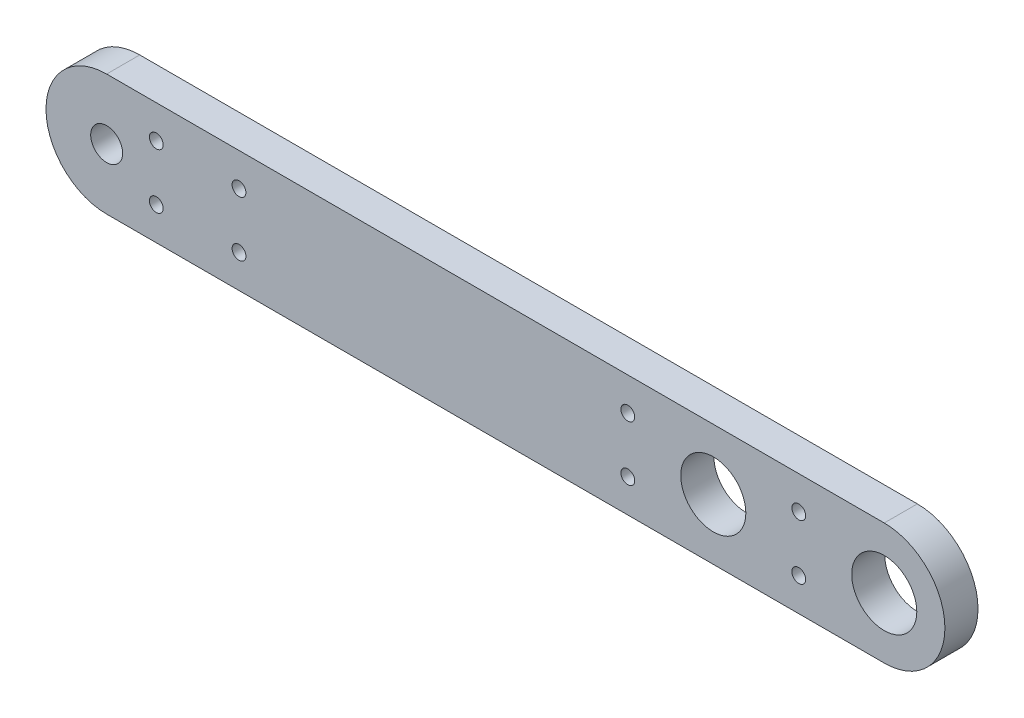
ISO-10303-21;
HEADER;
FILE_DESCRIPTION(('STEP AP214'),'2;1');
FILE_NAME('part.step','',(''),(''),'','','');
FILE_SCHEMA(('AUTOMOTIVE_DESIGN { 1 0 10303 214 1 1 1 1 }'));
ENDSEC;
DATA;
#1=APPLICATION_CONTEXT('core data for automotive mechanical design processes');
#2=APPLICATION_PROTOCOL_DEFINITION('international standard','automotive_design',2000,#1);
#3=PRODUCT_CONTEXT('',#1,'mechanical');
#4=PRODUCT('Part','Part','',(#3));
#5=PRODUCT_RELATED_PRODUCT_CATEGORY('part','',(#4));
#6=PRODUCT_DEFINITION_FORMATION('','',#4);
#7=PRODUCT_DEFINITION_CONTEXT('part definition',#1,'design');
#8=PRODUCT_DEFINITION('design','',#6,#7);
#9=PRODUCT_DEFINITION_SHAPE('','',#8);
#10=(LENGTH_UNIT() NAMED_UNIT(*) SI_UNIT(.MILLI.,.METRE.));
#11=(NAMED_UNIT(*) PLANE_ANGLE_UNIT() SI_UNIT($,.RADIAN.));
#12=(NAMED_UNIT(*) SI_UNIT($,.STERADIAN.) SOLID_ANGLE_UNIT());
#13=UNCERTAINTY_MEASURE_WITH_UNIT(LENGTH_MEASURE(1.E-05),#10,'distance_accuracy_value','');
#14=(GEOMETRIC_REPRESENTATION_CONTEXT(3) GLOBAL_UNCERTAINTY_ASSIGNED_CONTEXT((#13)) GLOBAL_UNIT_ASSIGNED_CONTEXT((#10,
#11,#12)) REPRESENTATION_CONTEXT('',''));
#15=CARTESIAN_POINT('',(0.,0.,0.));
#16=DIRECTION('',(0.,0.,1.));
#17=DIRECTION('',(1.,0.,0.));
#18=AXIS2_PLACEMENT_3D('',#15,#16,#17);
#19=CARTESIAN_POINT('',(15.5,0.,3.));
#20=DIRECTION('',(0.,0.,1.));
#21=DIRECTION('',(1.,0.,0.));
#22=AXIS2_PLACEMENT_3D('',#19,#20,#21);
#23=PLANE('',#22);
#24=CARTESIAN_POINT('',(7.75,-2.49999999999999,3.));
#25=DIRECTION('',(0.,0.,1.));
#26=DIRECTION('',(1.,0.,0.));
#27=AXIS2_PLACEMENT_3D('',#24,#25,#26);
#28=CIRCLE('',#27,0.625000000000001);
#29=CARTESIAN_POINT('',(8.375,-2.49999999999999,3.));
#30=VERTEX_POINT('',#29);
#31=EDGE_CURVE('E173',#30,#30,#28,.T.);
#32=ORIENTED_EDGE('',*,*,#31,.F.);
#33=EDGE_LOOP('',(#32));
#34=FACE_BOUND('',#33,.T.);
#35=CARTESIAN_POINT('',(-7.75,-2.49999999999999,3.));
#36=DIRECTION('',(0.,0.,1.));
#37=DIRECTION('',(1.,0.,0.));
#38=AXIS2_PLACEMENT_3D('',#35,#36,#37);
#39=CIRCLE('',#38,0.625);
#40=CARTESIAN_POINT('',(-7.125,-2.49999999999999,3.));
#41=VERTEX_POINT('',#40);
#42=EDGE_CURVE('E167',#41,#41,#39,.T.);
#43=ORIENTED_EDGE('',*,*,#42,.F.);
#44=EDGE_LOOP('',(#43));
#45=FACE_BOUND('',#44,.T.);
#46=CARTESIAN_POINT('',(-50.5,-2.49999999999999,3.));
#47=DIRECTION('',(0.,0.,1.));
#48=DIRECTION('',(1.,0.,0.));
#49=AXIS2_PLACEMENT_3D('',#46,#47,#48);
#50=CIRCLE('',#49,0.625000000000001);
#51=CARTESIAN_POINT('',(-49.875,-2.49999999999999,3.));
#52=VERTEX_POINT('',#51);
#53=EDGE_CURVE('E161',#52,#52,#50,.T.);
#54=ORIENTED_EDGE('',*,*,#53,.F.);
#55=EDGE_LOOP('',(#54));
#56=FACE_BOUND('',#55,.T.);
#57=CARTESIAN_POINT('',(-43.,-2.49999999999999,3.));
#58=DIRECTION('',(0.,0.,1.));
#59=DIRECTION('',(1.,0.,0.));
#60=AXIS2_PLACEMENT_3D('',#57,#58,#59);
#61=CIRCLE('',#60,0.625000000000001);
#62=CARTESIAN_POINT('',(-42.375,-2.49999999999999,3.));
#63=VERTEX_POINT('',#62);
#64=EDGE_CURVE('E155',#63,#63,#61,.T.);
#65=ORIENTED_EDGE('',*,*,#64,.F.);
#66=EDGE_LOOP('',(#65));
#67=FACE_BOUND('',#66,.T.);
#68=CARTESIAN_POINT('',(7.75,2.49999999999999,3.));
#69=DIRECTION('',(0.,0.,1.));
#70=DIRECTION('',(1.,0.,0.));
#71=AXIS2_PLACEMENT_3D('',#68,#69,#70);
#72=CIRCLE('',#71,0.625000000000001);
#73=CARTESIAN_POINT('',(8.375,2.49999999999999,3.));
#74=VERTEX_POINT('',#73);
#75=EDGE_CURVE('E149',#74,#74,#72,.T.);
#76=ORIENTED_EDGE('',*,*,#75,.F.);
#77=EDGE_LOOP('',(#76));
#78=FACE_BOUND('',#77,.T.);
#79=CARTESIAN_POINT('',(-7.75,2.49999999999999,3.));
#80=DIRECTION('',(0.,0.,1.));
#81=DIRECTION('',(1.,0.,0.));
#82=AXIS2_PLACEMENT_3D('',#79,#80,#81);
#83=CIRCLE('',#82,0.625);
#84=CARTESIAN_POINT('',(-7.125,2.49999999999999,3.));
#85=VERTEX_POINT('',#84);
#86=EDGE_CURVE('E143',#85,#85,#83,.T.);
#87=ORIENTED_EDGE('',*,*,#86,.F.);
#88=EDGE_LOOP('',(#87));
#89=FACE_BOUND('',#88,.T.);
#90=CARTESIAN_POINT('',(-50.5,2.49999999999999,3.));
#91=DIRECTION('',(0.,0.,1.));
#92=DIRECTION('',(1.,0.,0.));
#93=AXIS2_PLACEMENT_3D('',#90,#91,#92);
#94=CIRCLE('',#93,0.625000000000001);
#95=CARTESIAN_POINT('',(-49.875,2.49999999999999,3.));
#96=VERTEX_POINT('',#95);
#97=EDGE_CURVE('E137',#96,#96,#94,.T.);
#98=ORIENTED_EDGE('',*,*,#97,.F.);
#99=EDGE_LOOP('',(#98));
#100=FACE_BOUND('',#99,.T.);
#101=CARTESIAN_POINT('',(-43.,2.49999999999999,3.));
#102=DIRECTION('',(0.,0.,1.));
#103=DIRECTION('',(1.,0.,0.));
#104=AXIS2_PLACEMENT_3D('',#101,#102,#103);
#105=CIRCLE('',#104,0.625000000000001);
#106=CARTESIAN_POINT('',(-42.375,2.49999999999999,3.));
#107=VERTEX_POINT('',#106);
#108=EDGE_CURVE('E131',#107,#107,#105,.T.);
#109=ORIENTED_EDGE('',*,*,#108,.F.);
#110=EDGE_LOOP('',(#109));
#111=FACE_BOUND('',#110,.T.);
#112=CARTESIAN_POINT('',(0.,0.,3.));
#113=DIRECTION('',(0.,0.,1.));
#114=DIRECTION('',(1.,0.,0.));
#115=AXIS2_PLACEMENT_3D('',#112,#113,#114);
#116=CIRCLE('',#115,2.95);
#117=CARTESIAN_POINT('',(2.95,0.,3.));
#118=VERTEX_POINT('',#117);
#119=EDGE_CURVE('E114',#118,#118,#116,.T.);
#120=ORIENTED_EDGE('',*,*,#119,.F.);
#121=EDGE_LOOP('',(#120));
#122=FACE_BOUND('',#121,.T.);
#123=CARTESIAN_POINT('',(15.5,0.,3.));
#124=DIRECTION('',(0.,0.,1.));
#125=DIRECTION('',(1.,0.,0.));
#126=AXIS2_PLACEMENT_3D('',#123,#124,#125);
#127=CIRCLE('',#126,5.5);
#128=CARTESIAN_POINT('',(15.5,-5.5,3.));
#129=VERTEX_POINT('',#128);
#130=CARTESIAN_POINT('',(15.5,5.5,3.));
#131=VERTEX_POINT('',#130);
#132=EDGE_CURVE('E84',#129,#131,#127,.T.);
#133=ORIENTED_EDGE('',*,*,#132,.T.);
#134=DIRECTION('',(-1.,0.,0.));
#135=VECTOR('',#134,1.);
#136=CARTESIAN_POINT('',(15.5,5.5,3.));
#137=LINE('',#136,#135);
#138=CARTESIAN_POINT('',(-55.,5.49999999999999,3.));
#139=VERTEX_POINT('',#138);
#140=EDGE_CURVE('E79',#131,#139,#137,.T.);
#141=ORIENTED_EDGE('',*,*,#140,.T.);
#142=CARTESIAN_POINT('',(-55.,0.,3.));
#143=DIRECTION('',(0.,0.,1.));
#144=DIRECTION('',(1.,0.,0.));
#145=AXIS2_PLACEMENT_3D('',#142,#143,#144);
#146=CIRCLE('',#145,5.49999999999999);
#147=CARTESIAN_POINT('',(-55.,-5.49999999999999,3.));
#148=VERTEX_POINT('',#147);
#149=EDGE_CURVE('E82',#139,#148,#146,.T.);
#150=ORIENTED_EDGE('',*,*,#149,.T.);
#151=DIRECTION('',(1.,0.,0.));
#152=VECTOR('',#151,1.);
#153=CARTESIAN_POINT('',(-55.,-5.49999999999999,3.));
#154=LINE('',#153,#152);
#155=EDGE_CURVE('E49',#148,#129,#154,.T.);
#156=ORIENTED_EDGE('',*,*,#155,.T.);
#157=EDGE_LOOP('',(#133,#141,#150,#156));
#158=FACE_BOUND('',#157,.T.);
#159=CARTESIAN_POINT('',(-55.,0.,3.));
#160=DIRECTION('',(0.,0.,1.));
#161=DIRECTION('',(1.,0.,0.));
#162=AXIS2_PLACEMENT_3D('',#159,#160,#161);
#163=CIRCLE('',#162,1.45);
#164=CARTESIAN_POINT('',(-53.55,0.,3.));
#165=VERTEX_POINT('',#164);
#166=EDGE_CURVE('E99',#165,#165,#163,.T.);
#167=ORIENTED_EDGE('',*,*,#166,.F.);
#168=EDGE_LOOP('',(#167));
#169=FACE_BOUND('',#168,.T.);
#170=CARTESIAN_POINT('',(15.5,0.,3.));
#171=DIRECTION('',(0.,0.,1.));
#172=DIRECTION('',(1.,0.,0.));
#173=AXIS2_PLACEMENT_3D('',#170,#171,#172);
#174=CIRCLE('',#173,2.95);
#175=CARTESIAN_POINT('',(18.45,0.,3.));
#176=VERTEX_POINT('',#175);
#177=EDGE_CURVE('E120',#176,#176,#174,.T.);
#178=ORIENTED_EDGE('',*,*,#177,.F.);
#179=EDGE_LOOP('',(#178));
#180=FACE_BOUND('',#179,.T.);
#181=ADVANCED_FACE('F32',(#34,#45,#56,#67,#78,#89,#100,#111,#122,#158,#169,#180),#23,.T.);
#182=CARTESIAN_POINT('',(15.5,0.,0.));
#183=DIRECTION('',(0.,0.,1.));
#184=DIRECTION('',(1.,0.,0.));
#185=AXIS2_PLACEMENT_3D('',#182,#183,#184);
#186=PLANE('',#185);
#187=CARTESIAN_POINT('',(7.75,-2.49999999999999,0.));
#188=DIRECTION('',(0.,0.,1.));
#189=DIRECTION('',(1.,0.,0.));
#190=AXIS2_PLACEMENT_3D('',#187,#188,#189);
#191=CIRCLE('',#190,0.624999999999999);
#192=CARTESIAN_POINT('',(8.375,-2.49999999999999,0.));
#193=VERTEX_POINT('',#192);
#194=EDGE_CURVE('E170',#193,#193,#191,.T.);
#195=ORIENTED_EDGE('',*,*,#194,.T.);
#196=EDGE_LOOP('',(#195));
#197=FACE_BOUND('',#196,.T.);
#198=CARTESIAN_POINT('',(-7.75,-2.49999999999999,0.));
#199=DIRECTION('',(0.,0.,1.));
#200=DIRECTION('',(1.,0.,0.));
#201=AXIS2_PLACEMENT_3D('',#198,#199,#200);
#202=CIRCLE('',#201,0.624999999999999);
#203=CARTESIAN_POINT('',(-7.125,-2.49999999999999,0.));
#204=VERTEX_POINT('',#203);
#205=EDGE_CURVE('E164',#204,#204,#202,.T.);
#206=ORIENTED_EDGE('',*,*,#205,.T.);
#207=EDGE_LOOP('',(#206));
#208=FACE_BOUND('',#207,.T.);
#209=CARTESIAN_POINT('',(-50.5,-2.49999999999999,0.));
#210=DIRECTION('',(0.,0.,1.));
#211=DIRECTION('',(1.,0.,0.));
#212=AXIS2_PLACEMENT_3D('',#209,#210,#211);
#213=CIRCLE('',#212,0.625000000000001);
#214=CARTESIAN_POINT('',(-49.875,-2.49999999999999,0.));
#215=VERTEX_POINT('',#214);
#216=EDGE_CURVE('E158',#215,#215,#213,.T.);
#217=ORIENTED_EDGE('',*,*,#216,.T.);
#218=EDGE_LOOP('',(#217));
#219=FACE_BOUND('',#218,.T.);
#220=CARTESIAN_POINT('',(-43.,-2.49999999999999,0.));
#221=DIRECTION('',(0.,0.,1.));
#222=DIRECTION('',(1.,0.,0.));
#223=AXIS2_PLACEMENT_3D('',#220,#221,#222);
#224=CIRCLE('',#223,0.625000000000001);
#225=CARTESIAN_POINT('',(-42.375,-2.49999999999999,0.));
#226=VERTEX_POINT('',#225);
#227=EDGE_CURVE('E152',#226,#226,#224,.T.);
#228=ORIENTED_EDGE('',*,*,#227,.T.);
#229=EDGE_LOOP('',(#228));
#230=FACE_BOUND('',#229,.T.);
#231=CARTESIAN_POINT('',(7.75,2.49999999999999,0.));
#232=DIRECTION('',(0.,0.,1.));
#233=DIRECTION('',(1.,0.,0.));
#234=AXIS2_PLACEMENT_3D('',#231,#232,#233);
#235=CIRCLE('',#234,0.624999999999999);
#236=CARTESIAN_POINT('',(8.375,2.49999999999999,0.));
#237=VERTEX_POINT('',#236);
#238=EDGE_CURVE('E146',#237,#237,#235,.T.);
#239=ORIENTED_EDGE('',*,*,#238,.T.);
#240=EDGE_LOOP('',(#239));
#241=FACE_BOUND('',#240,.T.);
#242=CARTESIAN_POINT('',(-7.75,2.49999999999999,0.));
#243=DIRECTION('',(0.,0.,1.));
#244=DIRECTION('',(1.,0.,0.));
#245=AXIS2_PLACEMENT_3D('',#242,#243,#244);
#246=CIRCLE('',#245,0.624999999999999);
#247=CARTESIAN_POINT('',(-7.125,2.49999999999999,0.));
#248=VERTEX_POINT('',#247);
#249=EDGE_CURVE('E140',#248,#248,#246,.T.);
#250=ORIENTED_EDGE('',*,*,#249,.T.);
#251=EDGE_LOOP('',(#250));
#252=FACE_BOUND('',#251,.T.);
#253=CARTESIAN_POINT('',(-50.5,2.49999999999999,0.));
#254=DIRECTION('',(0.,0.,1.));
#255=DIRECTION('',(1.,0.,0.));
#256=AXIS2_PLACEMENT_3D('',#253,#254,#255);
#257=CIRCLE('',#256,0.625000000000001);
#258=CARTESIAN_POINT('',(-49.875,2.49999999999999,0.));
#259=VERTEX_POINT('',#258);
#260=EDGE_CURVE('E134',#259,#259,#257,.T.);
#261=ORIENTED_EDGE('',*,*,#260,.T.);
#262=EDGE_LOOP('',(#261));
#263=FACE_BOUND('',#262,.T.);
#264=CARTESIAN_POINT('',(-43.,2.49999999999999,0.));
#265=DIRECTION('',(0.,0.,1.));
#266=DIRECTION('',(1.,0.,0.));
#267=AXIS2_PLACEMENT_3D('',#264,#265,#266);
#268=CIRCLE('',#267,0.625000000000001);
#269=CARTESIAN_POINT('',(-42.375,2.49999999999999,0.));
#270=VERTEX_POINT('',#269);
#271=EDGE_CURVE('E126',#270,#270,#268,.T.);
#272=ORIENTED_EDGE('',*,*,#271,.T.);
#273=EDGE_LOOP('',(#272));
#274=FACE_BOUND('',#273,.T.);
#275=CARTESIAN_POINT('',(0.,0.,0.));
#276=DIRECTION('',(0.,0.,1.));
#277=DIRECTION('',(1.,0.,0.));
#278=AXIS2_PLACEMENT_3D('',#275,#276,#277);
#279=CIRCLE('',#278,2.95);
#280=CARTESIAN_POINT('',(2.95,0.,0.));
#281=VERTEX_POINT('',#280);
#282=EDGE_CURVE('E117',#281,#281,#279,.T.);
#283=ORIENTED_EDGE('',*,*,#282,.T.);
#284=EDGE_LOOP('',(#283));
#285=FACE_BOUND('',#284,.T.);
#286=CARTESIAN_POINT('',(15.5,0.,0.));
#287=DIRECTION('',(0.,0.,1.));
#288=DIRECTION('',(1.,0.,0.));
#289=AXIS2_PLACEMENT_3D('',#286,#287,#288);
#290=CIRCLE('',#289,5.5);
#291=CARTESIAN_POINT('',(15.5,-5.5,0.));
#292=VERTEX_POINT('',#291);
#293=CARTESIAN_POINT('',(15.5,5.5,0.));
#294=VERTEX_POINT('',#293);
#295=EDGE_CURVE('E96',#292,#294,#290,.T.);
#296=ORIENTED_EDGE('',*,*,#295,.F.);
#297=DIRECTION('',(1.,0.,0.));
#298=VECTOR('',#297,1.);
#299=CARTESIAN_POINT('',(-55.,-5.49999999999999,0.));
#300=LINE('',#299,#298);
#301=CARTESIAN_POINT('',(-55.,-5.49999999999999,0.));
#302=VERTEX_POINT('',#301);
#303=EDGE_CURVE('E72',#302,#292,#300,.T.);
#304=ORIENTED_EDGE('',*,*,#303,.F.);
#305=CARTESIAN_POINT('',(-55.,0.,0.));
#306=DIRECTION('',(0.,0.,1.));
#307=DIRECTION('',(1.,0.,0.));
#308=AXIS2_PLACEMENT_3D('',#305,#306,#307);
#309=CIRCLE('',#308,5.49999999999999);
#310=CARTESIAN_POINT('',(-55.,5.49999999999999,0.));
#311=VERTEX_POINT('',#310);
#312=EDGE_CURVE('E66',#311,#302,#309,.T.);
#313=ORIENTED_EDGE('',*,*,#312,.F.);
#314=DIRECTION('',(-1.,0.,0.));
#315=VECTOR('',#314,1.);
#316=CARTESIAN_POINT('',(15.5,5.5,0.));
#317=LINE('',#316,#315);
#318=EDGE_CURVE('E88',#294,#311,#317,.T.);
#319=ORIENTED_EDGE('',*,*,#318,.F.);
#320=EDGE_LOOP('',(#296,#304,#313,#319));
#321=FACE_BOUND('',#320,.T.);
#322=CARTESIAN_POINT('',(-55.,0.,0.));
#323=DIRECTION('',(0.,0.,1.));
#324=DIRECTION('',(1.,0.,0.));
#325=AXIS2_PLACEMENT_3D('',#322,#323,#324);
#326=CIRCLE('',#325,1.45);
#327=CARTESIAN_POINT('',(-53.55,0.,0.));
#328=VERTEX_POINT('',#327);
#329=EDGE_CURVE('E111',#328,#328,#326,.T.);
#330=ORIENTED_EDGE('',*,*,#329,.T.);
#331=EDGE_LOOP('',(#330));
#332=FACE_BOUND('',#331,.T.);
#333=CARTESIAN_POINT('',(15.5,0.,0.));
#334=DIRECTION('',(0.,0.,1.));
#335=DIRECTION('',(1.,0.,0.));
#336=AXIS2_PLACEMENT_3D('',#333,#334,#335);
#337=CIRCLE('',#336,2.95);
#338=CARTESIAN_POINT('',(18.45,0.,0.));
#339=VERTEX_POINT('',#338);
#340=EDGE_CURVE('E123',#339,#339,#337,.T.);
#341=ORIENTED_EDGE('',*,*,#340,.T.);
#342=EDGE_LOOP('',(#341));
#343=FACE_BOUND('',#342,.T.);
#344=ADVANCED_FACE('F107',(#197,#208,#219,#230,#241,#252,#263,#274,#285,#321,#332,#343),#186,.F.);
#345=CARTESIAN_POINT('',(15.5,0.,3.));
#346=DIRECTION('',(0.,0.,-1.));
#347=DIRECTION('',(-1.,0.,0.));
#348=AXIS2_PLACEMENT_3D('',#345,#346,#347);
#349=CYLINDRICAL_SURFACE('',#348,5.5);
#350=ORIENTED_EDGE('',*,*,#295,.T.);
#351=DIRECTION('',(0.,0.,-1.));
#352=VECTOR('',#351,1.);
#353=CARTESIAN_POINT('',(15.5,5.5,3.));
#354=LINE('',#353,#352);
#355=EDGE_CURVE('E11',#131,#294,#354,.T.);
#356=ORIENTED_EDGE('',*,*,#355,.F.);
#357=ORIENTED_EDGE('',*,*,#132,.F.);
#358=DIRECTION('',(0.,0.,-1.));
#359=VECTOR('',#358,1.);
#360=CARTESIAN_POINT('',(15.5,-5.5,3.));
#361=LINE('',#360,#359);
#362=EDGE_CURVE('E92',#129,#292,#361,.T.);
#363=ORIENTED_EDGE('',*,*,#362,.T.);
#364=EDGE_LOOP('',(#350,#356,#357,#363));
#365=FACE_BOUND('',#364,.T.);
#366=ADVANCED_FACE('F34',(#365),#349,.T.);
#367=CARTESIAN_POINT('',(15.5,5.5,3.));
#368=DIRECTION('',(0.,-1.,0.));
#369=DIRECTION('',(1.,0.,0.));
#370=AXIS2_PLACEMENT_3D('',#367,#368,#369);
#371=PLANE('',#370);
#372=ORIENTED_EDGE('',*,*,#318,.T.);
#373=DIRECTION('',(0.,0.,-1.));
#374=VECTOR('',#373,1.);
#375=CARTESIAN_POINT('',(-55.,5.49999999999999,3.));
#376=LINE('',#375,#374);
#377=EDGE_CURVE('E41',#139,#311,#376,.T.);
#378=ORIENTED_EDGE('',*,*,#377,.F.);
#379=ORIENTED_EDGE('',*,*,#140,.F.);
#380=ORIENTED_EDGE('',*,*,#355,.T.);
#381=EDGE_LOOP('',(#372,#378,#379,#380));
#382=FACE_BOUND('',#381,.T.);
#383=ADVANCED_FACE('F87',(#382),#371,.F.);
#384=CARTESIAN_POINT('',(-55.,0.,3.));
#385=DIRECTION('',(0.,0.,-1.));
#386=DIRECTION('',(-1.,0.,0.));
#387=AXIS2_PLACEMENT_3D('',#384,#385,#386);
#388=CYLINDRICAL_SURFACE('',#387,5.49999999999999);
#389=ORIENTED_EDGE('',*,*,#312,.T.);
#390=DIRECTION('',(0.,0.,-1.));
#391=VECTOR('',#390,1.);
#392=CARTESIAN_POINT('',(-55.,-5.49999999999999,3.));
#393=LINE('',#392,#391);
#394=EDGE_CURVE('E89',#148,#302,#393,.T.);
#395=ORIENTED_EDGE('',*,*,#394,.F.);
#396=ORIENTED_EDGE('',*,*,#149,.F.);
#397=ORIENTED_EDGE('',*,*,#377,.T.);
#398=EDGE_LOOP('',(#389,#395,#396,#397));
#399=FACE_BOUND('',#398,.T.);
#400=ADVANCED_FACE('F90',(#399),#388,.T.);
#401=CARTESIAN_POINT('',(-55.,-5.49999999999999,3.));
#402=DIRECTION('',(0.,1.,0.));
#403=DIRECTION('',(-1.,0.,0.));
#404=AXIS2_PLACEMENT_3D('',#401,#402,#403);
#405=PLANE('',#404);
#406=ORIENTED_EDGE('',*,*,#303,.T.);
#407=ORIENTED_EDGE('',*,*,#362,.F.);
#408=ORIENTED_EDGE('',*,*,#155,.F.);
#409=ORIENTED_EDGE('',*,*,#394,.T.);
#410=EDGE_LOOP('',(#406,#407,#408,#409));
#411=FACE_BOUND('',#410,.T.);
#412=ADVANCED_FACE('F104',(#411),#405,.F.);
#413=CARTESIAN_POINT('',(-55.,0.,3.));
#414=DIRECTION('',(0.,0.,-1.));
#415=DIRECTION('',(-1.,0.,0.));
#416=AXIS2_PLACEMENT_3D('',#413,#414,#415);
#417=CYLINDRICAL_SURFACE('',#416,1.45);
#418=ORIENTED_EDGE('',*,*,#166,.T.);
#419=EDGE_LOOP('',(#418));
#420=FACE_BOUND('',#419,.T.);
#421=ORIENTED_EDGE('',*,*,#329,.F.);
#422=EDGE_LOOP('',(#421));
#423=FACE_BOUND('',#422,.T.);
#424=ADVANCED_FACE('F202',(#420,#423),#417,.F.);
#425=CARTESIAN_POINT('',(0.,0.,3.));
#426=DIRECTION('',(0.,0.,-1.));
#427=DIRECTION('',(-1.,0.,0.));
#428=AXIS2_PLACEMENT_3D('',#425,#426,#427);
#429=CYLINDRICAL_SURFACE('',#428,2.95);
#430=ORIENTED_EDGE('',*,*,#119,.T.);
#431=EDGE_LOOP('',(#430));
#432=FACE_BOUND('',#431,.T.);
#433=ORIENTED_EDGE('',*,*,#282,.F.);
#434=EDGE_LOOP('',(#433));
#435=FACE_BOUND('',#434,.T.);
#436=ADVANCED_FACE('F198',(#432,#435),#429,.F.);
#437=CARTESIAN_POINT('',(15.5,0.,3.));
#438=DIRECTION('',(0.,0.,-1.));
#439=DIRECTION('',(-1.,0.,0.));
#440=AXIS2_PLACEMENT_3D('',#437,#438,#439);
#441=CYLINDRICAL_SURFACE('',#440,2.95);
#442=ORIENTED_EDGE('',*,*,#177,.T.);
#443=EDGE_LOOP('',(#442));
#444=FACE_BOUND('',#443,.T.);
#445=ORIENTED_EDGE('',*,*,#340,.F.);
#446=EDGE_LOOP('',(#445));
#447=FACE_BOUND('',#446,.T.);
#448=ADVANCED_FACE('F201',(#444,#447),#441,.F.);
#449=CARTESIAN_POINT('',(-43.,2.49999999999999,3.));
#450=DIRECTION('',(0.,0.,1.));
#451=DIRECTION('',(1.,0.,0.));
#452=AXIS2_PLACEMENT_3D('',#449,#450,#451);
#453=CYLINDRICAL_SURFACE('',#452,0.625000000000001);
#454=ORIENTED_EDGE('',*,*,#271,.F.);
#455=EDGE_LOOP('',(#454));
#456=FACE_BOUND('',#455,.T.);
#457=ORIENTED_EDGE('',*,*,#108,.T.);
#458=EDGE_LOOP('',(#457));
#459=FACE_BOUND('',#458,.T.);
#460=ADVANCED_FACE('F247',(#456,#459),#453,.F.);
#461=CARTESIAN_POINT('',(-50.5,2.49999999999999,3.));
#462=DIRECTION('',(0.,0.,1.));
#463=DIRECTION('',(1.,0.,0.));
#464=AXIS2_PLACEMENT_3D('',#461,#462,#463);
#465=CYLINDRICAL_SURFACE('',#464,0.625000000000001);
#466=ORIENTED_EDGE('',*,*,#260,.F.);
#467=EDGE_LOOP('',(#466));
#468=FACE_BOUND('',#467,.T.);
#469=ORIENTED_EDGE('',*,*,#97,.T.);
#470=EDGE_LOOP('',(#469));
#471=FACE_BOUND('',#470,.T.);
#472=ADVANCED_FACE('F255',(#468,#471),#465,.F.);
#473=CARTESIAN_POINT('',(-7.75,2.49999999999999,3.));
#474=DIRECTION('',(0.,0.,1.));
#475=DIRECTION('',(1.,0.,0.));
#476=AXIS2_PLACEMENT_3D('',#473,#474,#475);
#477=CYLINDRICAL_SURFACE('',#476,0.624999999999999);
#478=ORIENTED_EDGE('',*,*,#249,.F.);
#479=EDGE_LOOP('',(#478));
#480=FACE_BOUND('',#479,.T.);
#481=ORIENTED_EDGE('',*,*,#86,.T.);
#482=EDGE_LOOP('',(#481));
#483=FACE_BOUND('',#482,.T.);
#484=ADVANCED_FACE('F263',(#480,#483),#477,.F.);
#485=CARTESIAN_POINT('',(7.75,2.49999999999999,3.));
#486=DIRECTION('',(0.,0.,1.));
#487=DIRECTION('',(1.,0.,0.));
#488=AXIS2_PLACEMENT_3D('',#485,#486,#487);
#489=CYLINDRICAL_SURFACE('',#488,0.625);
#490=ORIENTED_EDGE('',*,*,#238,.F.);
#491=EDGE_LOOP('',(#490));
#492=FACE_BOUND('',#491,.T.);
#493=ORIENTED_EDGE('',*,*,#75,.T.);
#494=EDGE_LOOP('',(#493));
#495=FACE_BOUND('',#494,.T.);
#496=ADVANCED_FACE('F271',(#492,#495),#489,.F.);
#497=CARTESIAN_POINT('',(-43.,-2.49999999999999,3.));
#498=DIRECTION('',(0.,0.,1.));
#499=DIRECTION('',(1.,0.,0.));
#500=AXIS2_PLACEMENT_3D('',#497,#498,#499);
#501=CYLINDRICAL_SURFACE('',#500,0.625000000000001);
#502=ORIENTED_EDGE('',*,*,#227,.F.);
#503=EDGE_LOOP('',(#502));
#504=FACE_BOUND('',#503,.T.);
#505=ORIENTED_EDGE('',*,*,#64,.T.);
#506=EDGE_LOOP('',(#505));
#507=FACE_BOUND('',#506,.T.);
#508=ADVANCED_FACE('F279',(#504,#507),#501,.F.);
#509=CARTESIAN_POINT('',(-50.5,-2.49999999999999,3.));
#510=DIRECTION('',(0.,0.,1.));
#511=DIRECTION('',(1.,0.,0.));
#512=AXIS2_PLACEMENT_3D('',#509,#510,#511);
#513=CYLINDRICAL_SURFACE('',#512,0.625000000000001);
#514=ORIENTED_EDGE('',*,*,#216,.F.);
#515=EDGE_LOOP('',(#514));
#516=FACE_BOUND('',#515,.T.);
#517=ORIENTED_EDGE('',*,*,#53,.T.);
#518=EDGE_LOOP('',(#517));
#519=FACE_BOUND('',#518,.T.);
#520=ADVANCED_FACE('F288',(#516,#519),#513,.F.);
#521=CARTESIAN_POINT('',(-7.75,-2.49999999999999,3.));
#522=DIRECTION('',(0.,0.,1.));
#523=DIRECTION('',(1.,0.,0.));
#524=AXIS2_PLACEMENT_3D('',#521,#522,#523);
#525=CYLINDRICAL_SURFACE('',#524,0.624999999999999);
#526=ORIENTED_EDGE('',*,*,#205,.F.);
#527=EDGE_LOOP('',(#526));
#528=FACE_BOUND('',#527,.T.);
#529=ORIENTED_EDGE('',*,*,#42,.T.);
#530=EDGE_LOOP('',(#529));
#531=FACE_BOUND('',#530,.T.);
#532=ADVANCED_FACE('F296',(#528,#531),#525,.F.);
#533=CARTESIAN_POINT('',(7.75,-2.49999999999999,3.));
#534=DIRECTION('',(0.,0.,1.));
#535=DIRECTION('',(1.,0.,0.));
#536=AXIS2_PLACEMENT_3D('',#533,#534,#535);
#537=CYLINDRICAL_SURFACE('',#536,0.625);
#538=ORIENTED_EDGE('',*,*,#194,.F.);
#539=EDGE_LOOP('',(#538));
#540=FACE_BOUND('',#539,.T.);
#541=ORIENTED_EDGE('',*,*,#31,.T.);
#542=EDGE_LOOP('',(#541));
#543=FACE_BOUND('',#542,.T.);
#544=ADVANCED_FACE('F177',(#540,#543),#537,.F.);
#545=CLOSED_SHELL('',(#181,#344,#366,#383,#400,#412,#424,#436,#448,#460,#472,#484,#496,#508,
#520,#532,#544));
#546=MANIFOLD_SOLID_BREP('B2',#545);
#547=ADVANCED_BREP_SHAPE_REPRESENTATION('',(#18,#546),#14);
#548=SHAPE_DEFINITION_REPRESENTATION(#9,#547);
ENDSEC;
END-ISO-10303-21;
